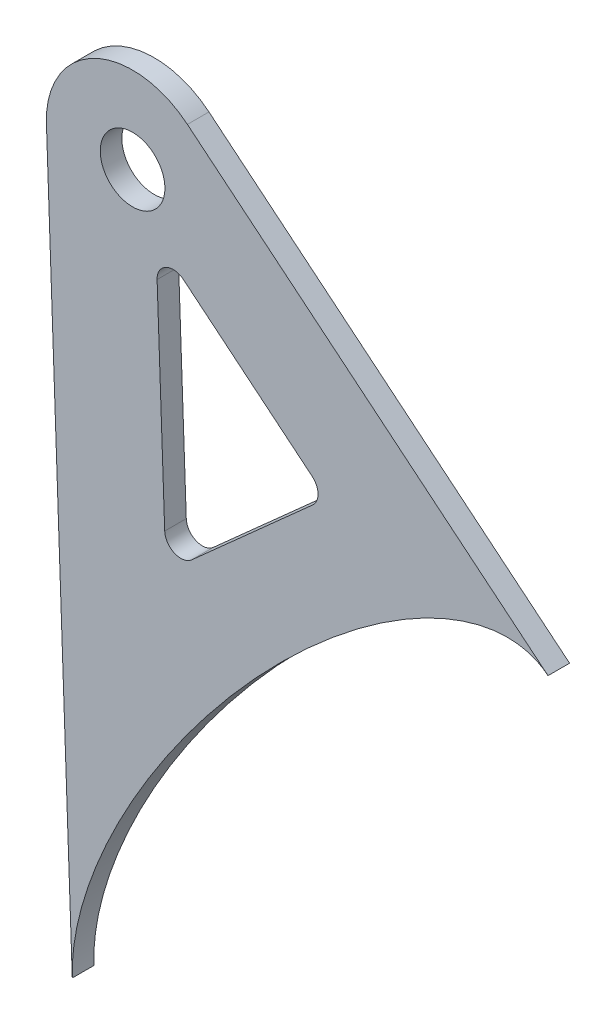
ISO-10303-21;
HEADER;
FILE_DESCRIPTION(('STEP AP214'),'2;1');
FILE_NAME('part.step','',(''),(''),'','','');
FILE_SCHEMA(('AUTOMOTIVE_DESIGN { 1 0 10303 214 1 1 1 1 }'));
ENDSEC;
DATA;
#1=APPLICATION_CONTEXT('core data for automotive mechanical design processes');
#2=APPLICATION_PROTOCOL_DEFINITION('international standard','automotive_design',2000,#1);
#3=PRODUCT_CONTEXT('',#1,'mechanical');
#4=PRODUCT('Part','Part','',(#3));
#5=PRODUCT_RELATED_PRODUCT_CATEGORY('part','',(#4));
#6=PRODUCT_DEFINITION_FORMATION('','',#4);
#7=PRODUCT_DEFINITION_CONTEXT('part definition',#1,'design');
#8=PRODUCT_DEFINITION('design','',#6,#7);
#9=PRODUCT_DEFINITION_SHAPE('','',#8);
#10=(LENGTH_UNIT() NAMED_UNIT(*) SI_UNIT(.MILLI.,.METRE.));
#11=(NAMED_UNIT(*) PLANE_ANGLE_UNIT() SI_UNIT($,.RADIAN.));
#12=(NAMED_UNIT(*) SI_UNIT($,.STERADIAN.) SOLID_ANGLE_UNIT());
#13=UNCERTAINTY_MEASURE_WITH_UNIT(LENGTH_MEASURE(1.E-05),#10,'distance_accuracy_value','');
#14=(GEOMETRIC_REPRESENTATION_CONTEXT(3) GLOBAL_UNCERTAINTY_ASSIGNED_CONTEXT((#13)) GLOBAL_UNIT_ASSIGNED_CONTEXT((#10,
#11,#12)) REPRESENTATION_CONTEXT('',''));
#15=CARTESIAN_POINT('',(0.,0.,0.));
#16=DIRECTION('',(0.,0.,1.));
#17=DIRECTION('',(1.,0.,0.));
#18=AXIS2_PLACEMENT_3D('',#15,#16,#17);
#19=CARTESIAN_POINT('',(1375.39150654888,-231.129570023266,434.28));
#20=DIRECTION('',(0.,0.,1.));
#21=DIRECTION('',(0.,-1.,0.));
#22=AXIS2_PLACEMENT_3D('',#19,#20,#21);
#23=PLANE('',#22);
#24=DIRECTION('',(0.035527138054527,-0.999368711968538,0.));
#25=VECTOR('',#24,1.);
#26=CARTESIAN_POINT('',(1352.00505030431,-200.284217104434,434.28));
#27=LINE('',#26,#25);
#28=CARTESIAN_POINT('',(1352.00505030431,-200.284217104434,434.28));
#29=VERTEX_POINT('',#28);
#30=CARTESIAN_POINT('',(1354.40386942977,-267.762345400856,434.28));
#31=VERTEX_POINT('',#30);
#32=EDGE_CURVE('E220',#29,#31,#27,.T.);
#33=ORIENTED_EDGE('',*,*,#32,.T.);
#34=CARTESIAN_POINT('',(1354.40386942977,-267.762345400856,434.28));
#35=CARTESIAN_POINT('',(1353.43245275836,-240.436659155121,434.28));
#36=CARTESIAN_POINT('',(1386.53706756762,-211.615049683143,434.28));
#37=CARTESIAN_POINT('',(1398.52725809821,-221.376205911584,434.28));
#38=CARTESIAN_POINT('',(1398.53435990197,-221.381987455749,434.28));
#39=CARTESIAN_POINT('',(1398.54144739585,-221.387791883071,434.28));
#40=CARTESIAN_POINT('',(1398.54852053125,-221.393619229834,434.28));
#41=(BOUNDED_CURVE() B_SPLINE_CURVE(3,(#34,#35,#36,#37,#38,#39,#40),.UNSPECIFIED.,.F.,
.F.) B_SPLINE_CURVE_WITH_KNOTS((4,3,4),(0.0852875382307011,0.5,0.500549054517509),
.UNSPECIFIED.) CURVE() GEOMETRIC_REPRESENTATION_ITEM() RATIONAL_B_SPLINE_CURVE((0.717041560496822,
0.352730571139875,0.447050050974268,1.,0.999267927309988,0.998536658515611,0.99780619361687)) REPRESENTATION_ITEM(''));
#42=CARTESIAN_POINT('',(1398.54852053125,-221.393619229834,434.28));
#43=VERTEX_POINT('',#42);
#44=EDGE_CURVE('E223',#31,#43,#41,.T.);
#45=ORIENTED_EDGE('',*,*,#44,.T.);
#46=DIRECTION('',(0.771801080668979,-0.635864051412089,0.));
#47=VECTOR('',#46,1.);
#48=CARTESIAN_POINT('',(1365.08691241126,-193.825591354697,434.28));
#49=LINE('',#48,#47);
#50=CARTESIAN_POINT('',(1365.08691241126,-193.825591354697,434.28));
#51=VERTEX_POINT('',#50);
#52=EDGE_CURVE('E229',#51,#43,#49,.T.);
#53=ORIENTED_EDGE('',*,*,#52,.F.);
#54=CARTESIAN_POINT('',(1360.,-200.,434.28));
#55=DIRECTION('',(0.,0.,1.));
#56=DIRECTION('',(1.,0.,0.));
#57=AXIS2_PLACEMENT_3D('',#54,#55,#56);
#58=CIRCLE('',#57,7.99999999993676);
#59=EDGE_CURVE('E377',#51,#29,#58,.T.);
#60=ORIENTED_EDGE('',*,*,#59,.T.);
#61=EDGE_LOOP('',(#33,#45,#53,#60));
#62=FACE_BOUND('',#61,.T.);
#63=CARTESIAN_POINT('',(1364.47997732206,-227.50430289175,434.28));
#64=DIRECTION('',(0.,0.,1.));
#65=DIRECTION('',(1.,0.,0.));
#66=AXIS2_PLACEMENT_3D('',#63,#64,#65);
#67=CIRCLE('',#66,1.49999999999995);
#68=CARTESIAN_POINT('',(1365.47901822837,-228.623193980065,434.28));
#69=VERTEX_POINT('',#68);
#70=CARTESIAN_POINT('',(1362.9809242541,-227.557593598832,434.28));
#71=VERTEX_POINT('',#70);
#72=EDGE_CURVE('E179',#69,#71,#67,.F.);
#73=ORIENTED_EDGE('',*,*,#72,.T.);
#74=DIRECTION('',(0.0355271380545357,-0.999368711968538,0.));
#75=VECTOR('',#74,1.);
#76=CARTESIAN_POINT('',(1353.18123393235,48.1050246370281,434.28));
#77=LINE('',#76,#75);
#78=CARTESIAN_POINT('',(1362.27490228427,-207.697387985437,434.28));
#79=VERTEX_POINT('',#78);
#80=EDGE_CURVE('E197',#79,#71,#77,.T.);
#81=ORIENTED_EDGE('',*,*,#80,.F.);
#82=CARTESIAN_POINT('',(1363.77395535222,-207.644097278355,434.28));
#83=DIRECTION('',(0.,0.,1.));
#84=DIRECTION('',(1.,0.,0.));
#85=AXIS2_PLACEMENT_3D('',#82,#83,#84);
#86=CIRCLE('',#85,1.50000000000002);
#87=CARTESIAN_POINT('',(1364.72775142934,-206.486395657352,434.28));
#88=VERTEX_POINT('',#87);
#89=EDGE_CURVE('E195',#88,#79,#86,.T.);
#90=ORIENTED_EDGE('',*,*,#89,.F.);
#91=DIRECTION('',(0.771801080668963,-0.635864051412109,0.));
#92=VECTOR('',#91,1.);
#93=CARTESIAN_POINT('',(450.455564443834,546.755380586496,434.28));
#94=LINE('',#93,#92);
#95=CARTESIAN_POINT('',(1376.66340859259,-216.319830087778,434.28));
#96=VERTEX_POINT('',#95);
#97=EDGE_CURVE('E190',#88,#96,#94,.T.);
#98=ORIENTED_EDGE('',*,*,#97,.T.);
#99=CARTESIAN_POINT('',(1375.70961251547,-217.477531708782,434.28));
#100=DIRECTION('',(0.,0.,1.));
#101=DIRECTION('',(1.,0.,0.));
#102=AXIS2_PLACEMENT_3D('',#99,#100,#101);
#103=CIRCLE('',#102,1.50000000000003);
#104=CARTESIAN_POINT('',(1376.70865342178,-218.596422797098,434.28));
#105=VERTEX_POINT('',#104);
#106=EDGE_CURVE('E188',#105,#96,#103,.T.);
#107=ORIENTED_EDGE('',*,*,#106,.F.);
#108=DIRECTION('',(-0.745927392210289,-0.666027270875869,0.));
#109=VECTOR('',#108,1.);
#110=CARTESIAN_POINT('',(719.297841581458,-805.588579710492,434.28));
#111=LINE('',#110,#109);
#112=EDGE_CURVE('E171',#105,#69,#111,.T.);
#113=ORIENTED_EDGE('',*,*,#112,.T.);
#114=EDGE_LOOP('',(#73,#81,#90,#98,#107,#113));
#115=FACE_BOUND('',#114,.T.);
#116=CARTESIAN_POINT('',(1360.,-200.,434.28));
#117=DIRECTION('',(0.,0.,1.));
#118=DIRECTION('',(1.,0.,0.));
#119=AXIS2_PLACEMENT_3D('',#116,#117,#118);
#120=CIRCLE('',#119,2.99999999999993);
#121=CARTESIAN_POINT('',(1363.,-200.,434.28));
#122=VERTEX_POINT('',#121);
#123=EDGE_CURVE('E200',#122,#122,#120,.T.);
#124=ORIENTED_EDGE('',*,*,#123,.F.);
#125=EDGE_LOOP('',(#124));
#126=FACE_BOUND('',#125,.T.);
#127=ADVANCED_FACE('F89',(#62,#115,#126),#23,.T.);
#128=CARTESIAN_POINT('',(1375.39150654888,-231.129570023266,432.28));
#129=DIRECTION('',(0.,0.,1.));
#130=DIRECTION('',(0.,-1.,0.));
#131=AXIS2_PLACEMENT_3D('',#128,#129,#130);
#132=PLANE('',#131);
#133=DIRECTION('',(0.0355271380545357,-0.999368711968538,0.));
#134=VECTOR('',#133,1.);
#135=CARTESIAN_POINT('',(1353.18123393235,48.1050246370281,432.28));
#136=LINE('',#135,#134);
#137=CARTESIAN_POINT('',(1362.27490228427,-207.697387985437,432.28));
#138=VERTEX_POINT('',#137);
#139=CARTESIAN_POINT('',(1362.9809242541,-227.557593598832,432.28));
#140=VERTEX_POINT('',#139);
#141=EDGE_CURVE('E184',#138,#140,#136,.T.);
#142=ORIENTED_EDGE('',*,*,#141,.T.);
#143=CARTESIAN_POINT('',(1364.47997732206,-227.50430289175,432.28));
#144=DIRECTION('',(0.,0.,1.));
#145=DIRECTION('',(1.,0.,0.));
#146=AXIS2_PLACEMENT_3D('',#143,#144,#145);
#147=CIRCLE('',#146,1.49999999999995);
#148=CARTESIAN_POINT('',(1365.47901822837,-228.623193980065,432.28));
#149=VERTEX_POINT('',#148);
#150=EDGE_CURVE('E112',#149,#140,#147,.F.);
#151=ORIENTED_EDGE('',*,*,#150,.F.);
#152=DIRECTION('',(-0.745927392210289,-0.666027270875869,0.));
#153=VECTOR('',#152,1.);
#154=CARTESIAN_POINT('',(719.297841581458,-805.588579710492,432.28));
#155=LINE('',#154,#153);
#156=CARTESIAN_POINT('',(1376.70865342178,-218.596422797098,432.28));
#157=VERTEX_POINT('',#156);
#158=EDGE_CURVE('E174',#157,#149,#155,.T.);
#159=ORIENTED_EDGE('',*,*,#158,.F.);
#160=CARTESIAN_POINT('',(1375.70961251547,-217.477531708782,432.28));
#161=DIRECTION('',(0.,0.,1.));
#162=DIRECTION('',(1.,0.,0.));
#163=AXIS2_PLACEMENT_3D('',#160,#161,#162);
#164=CIRCLE('',#163,1.50000000000003);
#165=CARTESIAN_POINT('',(1376.66340859259,-216.319830087778,432.28));
#166=VERTEX_POINT('',#165);
#167=EDGE_CURVE('E202',#157,#166,#164,.T.);
#168=ORIENTED_EDGE('',*,*,#167,.T.);
#169=DIRECTION('',(0.771801080668963,-0.635864051412109,0.));
#170=VECTOR('',#169,1.);
#171=CARTESIAN_POINT('',(450.455564443834,546.755380586496,432.28));
#172=LINE('',#171,#170);
#173=CARTESIAN_POINT('',(1364.72775142934,-206.486395657352,432.28));
#174=VERTEX_POINT('',#173);
#175=EDGE_CURVE('E205',#174,#166,#172,.T.);
#176=ORIENTED_EDGE('',*,*,#175,.F.);
#177=CARTESIAN_POINT('',(1363.77395535222,-207.644097278355,432.28));
#178=DIRECTION('',(0.,0.,1.));
#179=DIRECTION('',(1.,0.,0.));
#180=AXIS2_PLACEMENT_3D('',#177,#178,#179);
#181=CIRCLE('',#180,1.50000000000002);
#182=EDGE_CURVE('E208',#174,#138,#181,.T.);
#183=ORIENTED_EDGE('',*,*,#182,.T.);
#184=EDGE_LOOP('',(#142,#151,#159,#168,#176,#183));
#185=FACE_BOUND('',#184,.T.);
#186=DIRECTION('',(0.035527138054527,-0.999368711968538,0.));
#187=VECTOR('',#186,1.);
#188=CARTESIAN_POINT('',(1352.00505030431,-200.284217104434,432.28));
#189=LINE('',#188,#187);
#190=CARTESIAN_POINT('',(1352.00505030431,-200.284217104434,432.28));
#191=VERTEX_POINT('',#190);
#192=CARTESIAN_POINT('',(1354.40386942977,-267.762345400856,432.28));
#193=VERTEX_POINT('',#192);
#194=EDGE_CURVE('E175',#191,#193,#189,.T.);
#195=ORIENTED_EDGE('',*,*,#194,.F.);
#196=CARTESIAN_POINT('',(1360.,-200.,432.28));
#197=DIRECTION('',(0.,0.,1.));
#198=DIRECTION('',(1.,0.,0.));
#199=AXIS2_PLACEMENT_3D('',#196,#197,#198);
#200=CIRCLE('',#199,7.99999999993676);
#201=CARTESIAN_POINT('',(1365.08691241126,-193.825591354697,432.28));
#202=VERTEX_POINT('',#201);
#203=EDGE_CURVE('E224',#202,#191,#200,.T.);
#204=ORIENTED_EDGE('',*,*,#203,.F.);
#205=DIRECTION('',(0.771801080668979,-0.635864051412089,0.));
#206=VECTOR('',#205,1.);
#207=CARTESIAN_POINT('',(1365.08691241126,-193.825591354697,432.28));
#208=LINE('',#207,#206);
#209=CARTESIAN_POINT('',(1398.54852053125,-221.393619229834,432.28));
#210=VERTEX_POINT('',#209);
#211=EDGE_CURVE('E375',#202,#210,#208,.T.);
#212=ORIENTED_EDGE('',*,*,#211,.T.);
#213=CARTESIAN_POINT('',(1354.40386942977,-267.762345400856,432.28));
#214=CARTESIAN_POINT('',(1353.43245275836,-240.436659155121,432.28));
#215=CARTESIAN_POINT('',(1386.53706756762,-211.615049683143,432.28));
#216=CARTESIAN_POINT('',(1398.52725809821,-221.376205911584,432.28));
#217=CARTESIAN_POINT('',(1398.53435990197,-221.381987455749,432.28));
#218=CARTESIAN_POINT('',(1398.54144739585,-221.387791883071,432.28));
#219=CARTESIAN_POINT('',(1398.54852053125,-221.393619229834,432.28));
#220=(BOUNDED_CURVE() B_SPLINE_CURVE(3,(#213,#214,#215,#216,#217,#218,#219),.UNSPECIFIED.,.F.,
.F.) B_SPLINE_CURVE_WITH_KNOTS((4,3,4),(0.0852875382307011,0.5,0.500549054517509),
.UNSPECIFIED.) CURVE() GEOMETRIC_REPRESENTATION_ITEM() RATIONAL_B_SPLINE_CURVE((0.717041560496822,
0.352730571139875,0.447050050974268,1.,0.999267927309988,0.998536658515611,0.99780619361687)) REPRESENTATION_ITEM(''));
#221=EDGE_CURVE('E372',#193,#210,#220,.T.);
#222=ORIENTED_EDGE('',*,*,#221,.F.);
#223=EDGE_LOOP('',(#195,#204,#212,#222));
#224=FACE_BOUND('',#223,.T.);
#225=CARTESIAN_POINT('',(1360.,-200.,432.28));
#226=DIRECTION('',(0.,0.,1.));
#227=DIRECTION('',(1.,0.,0.));
#228=AXIS2_PLACEMENT_3D('',#225,#226,#227);
#229=CIRCLE('',#228,2.99999999999993);
#230=CARTESIAN_POINT('',(1363.,-200.,432.28));
#231=VERTEX_POINT('',#230);
#232=EDGE_CURVE('E282',#231,#231,#229,.T.);
#233=ORIENTED_EDGE('',*,*,#232,.T.);
#234=EDGE_LOOP('',(#233));
#235=FACE_BOUND('',#234,.T.);
#236=ADVANCED_FACE('F246',(#185,#224,#235),#132,.F.);
#237=CARTESIAN_POINT('',(1352.00505030431,-200.284217104434,434.28));
#238=DIRECTION('',(0.999368711968538,0.035527138054527,0.));
#239=DIRECTION('',(-0.035527138054527,0.999368711968538,0.));
#240=AXIS2_PLACEMENT_3D('',#237,#238,#239);
#241=PLANE('',#240);
#242=ORIENTED_EDGE('',*,*,#194,.T.);
#243=DIRECTION('',(0.,0.,-1.));
#244=VECTOR('',#243,1.);
#245=CARTESIAN_POINT('',(1354.40386942977,-267.762345400856,434.28));
#246=LINE('',#245,#244);
#247=EDGE_CURVE('E12',#31,#193,#246,.T.);
#248=ORIENTED_EDGE('',*,*,#247,.F.);
#249=ORIENTED_EDGE('',*,*,#32,.F.);
#250=DIRECTION('',(0.,0.,-1.));
#251=VECTOR('',#250,1.);
#252=CARTESIAN_POINT('',(1352.00505030431,-200.284217104434,434.28));
#253=LINE('',#252,#251);
#254=EDGE_CURVE('E369',#29,#191,#253,.T.);
#255=ORIENTED_EDGE('',*,*,#254,.T.);
#256=EDGE_LOOP('',(#242,#248,#249,#255));
#257=FACE_BOUND('',#256,.T.);
#258=ADVANCED_FACE('F91',(#257),#241,.F.);
#259=DIRECTION('',(0.,0.,-1.));
#260=VECTOR('',#259,1.);
#261=SURFACE_OF_LINEAR_EXTRUSION('',#41,#260);
#262=ORIENTED_EDGE('',*,*,#221,.T.);
#263=DIRECTION('',(0.,0.,-1.));
#264=VECTOR('',#263,1.);
#265=CARTESIAN_POINT('',(1398.54852053125,-221.393619229834,434.28));
#266=LINE('',#265,#264);
#267=EDGE_CURVE('E97',#43,#210,#266,.T.);
#268=ORIENTED_EDGE('',*,*,#267,.F.);
#269=ORIENTED_EDGE('',*,*,#44,.F.);
#270=ORIENTED_EDGE('',*,*,#247,.T.);
#271=EDGE_LOOP('',(#262,#268,#269,#270));
#272=FACE_BOUND('',#271,.T.);
#273=ADVANCED_FACE('F234',(#272),#261,.F.);
#274=CARTESIAN_POINT('',(1365.08691241126,-193.825591354697,434.28));
#275=DIRECTION('',(0.635864051412089,0.771801080668979,0.));
#276=DIRECTION('',(-0.771801080668979,0.635864051412089,0.));
#277=AXIS2_PLACEMENT_3D('',#274,#275,#276);
#278=PLANE('',#277);
#279=ORIENTED_EDGE('',*,*,#211,.F.);
#280=DIRECTION('',(0.,0.,-1.));
#281=VECTOR('',#280,1.);
#282=CARTESIAN_POINT('',(1365.08691241126,-193.825591354697,434.28));
#283=LINE('',#282,#281);
#284=EDGE_CURVE('E388',#51,#202,#283,.T.);
#285=ORIENTED_EDGE('',*,*,#284,.F.);
#286=ORIENTED_EDGE('',*,*,#52,.T.);
#287=ORIENTED_EDGE('',*,*,#267,.T.);
#288=EDGE_LOOP('',(#279,#285,#286,#287));
#289=FACE_BOUND('',#288,.T.);
#290=ADVANCED_FACE('F237',(#289),#278,.T.);
#291=CARTESIAN_POINT('',(1360.,-200.,434.28));
#292=DIRECTION('',(0.,0.,-1.));
#293=DIRECTION('',(-1.,0.,0.));
#294=AXIS2_PLACEMENT_3D('',#291,#292,#293);
#295=CYLINDRICAL_SURFACE('',#294,7.99999999993676);
#296=ORIENTED_EDGE('',*,*,#203,.T.);
#297=ORIENTED_EDGE('',*,*,#254,.F.);
#298=ORIENTED_EDGE('',*,*,#59,.F.);
#299=ORIENTED_EDGE('',*,*,#284,.T.);
#300=EDGE_LOOP('',(#296,#297,#298,#299));
#301=FACE_BOUND('',#300,.T.);
#302=ADVANCED_FACE('F241',(#301),#295,.T.);
#303=CARTESIAN_POINT('',(1364.47997732206,-227.50430289175,434.28));
#304=DIRECTION('',(0.,0.,-1.));
#305=DIRECTION('',(-1.,0.,0.));
#306=AXIS2_PLACEMENT_3D('',#303,#304,#305);
#307=CYLINDRICAL_SURFACE('',#306,1.49999999999995);
#308=ORIENTED_EDGE('',*,*,#150,.T.);
#309=DIRECTION('',(0.,0.,-1.));
#310=VECTOR('',#309,1.);
#311=CARTESIAN_POINT('',(1362.9809242541,-227.557593598832,434.28));
#312=LINE('',#311,#310);
#313=EDGE_CURVE('E181',#71,#140,#312,.T.);
#314=ORIENTED_EDGE('',*,*,#313,.F.);
#315=ORIENTED_EDGE('',*,*,#72,.F.);
#316=DIRECTION('',(0.,0.,-1.));
#317=VECTOR('',#316,1.);
#318=CARTESIAN_POINT('',(1365.47901822837,-228.623193980065,434.28));
#319=LINE('',#318,#317);
#320=EDGE_CURVE('E167',#69,#149,#319,.T.);
#321=ORIENTED_EDGE('',*,*,#320,.T.);
#322=EDGE_LOOP('',(#308,#314,#315,#321));
#323=FACE_BOUND('',#322,.T.);
#324=ADVANCED_FACE('F180',(#323),#307,.F.);
#325=CARTESIAN_POINT('',(719.297841581458,-805.588579710492,434.28));
#326=DIRECTION('',(0.666027270875869,-0.745927392210289,0.));
#327=DIRECTION('',(0.745927392210289,0.666027270875869,0.));
#328=AXIS2_PLACEMENT_3D('',#325,#326,#327);
#329=PLANE('',#328);
#330=ORIENTED_EDGE('',*,*,#158,.T.);
#331=ORIENTED_EDGE('',*,*,#320,.F.);
#332=ORIENTED_EDGE('',*,*,#112,.F.);
#333=DIRECTION('',(0.,0.,-1.));
#334=VECTOR('',#333,1.);
#335=CARTESIAN_POINT('',(1376.70865342178,-218.596422797098,434.28));
#336=LINE('',#335,#334);
#337=EDGE_CURVE('E176',#105,#157,#336,.T.);
#338=ORIENTED_EDGE('',*,*,#337,.T.);
#339=EDGE_LOOP('',(#330,#331,#332,#338));
#340=FACE_BOUND('',#339,.T.);
#341=ADVANCED_FACE('F169',(#340),#329,.F.);
#342=CARTESIAN_POINT('',(1375.70961251547,-217.477531708782,434.28));
#343=DIRECTION('',(0.,0.,-1.));
#344=DIRECTION('',(-1.,0.,0.));
#345=AXIS2_PLACEMENT_3D('',#342,#343,#344);
#346=CYLINDRICAL_SURFACE('',#345,1.50000000000003);
#347=ORIENTED_EDGE('',*,*,#167,.F.);
#348=ORIENTED_EDGE('',*,*,#337,.F.);
#349=ORIENTED_EDGE('',*,*,#106,.T.);
#350=DIRECTION('',(0.,0.,-1.));
#351=VECTOR('',#350,1.);
#352=CARTESIAN_POINT('',(1376.66340859259,-216.319830087778,434.28));
#353=LINE('',#352,#351);
#354=EDGE_CURVE('E217',#96,#166,#353,.T.);
#355=ORIENTED_EDGE('',*,*,#354,.T.);
#356=EDGE_LOOP('',(#347,#348,#349,#355));
#357=FACE_BOUND('',#356,.T.);
#358=ADVANCED_FACE('F257',(#357),#346,.F.);
#359=CARTESIAN_POINT('',(450.455564443834,546.755380586496,434.28));
#360=DIRECTION('',(0.635864051412109,0.771801080668963,0.));
#361=DIRECTION('',(-0.771801080668963,0.635864051412109,0.));
#362=AXIS2_PLACEMENT_3D('',#359,#360,#361);
#363=PLANE('',#362);
#364=ORIENTED_EDGE('',*,*,#175,.T.);
#365=ORIENTED_EDGE('',*,*,#354,.F.);
#366=ORIENTED_EDGE('',*,*,#97,.F.);
#367=DIRECTION('',(0.,0.,-1.));
#368=VECTOR('',#367,1.);
#369=CARTESIAN_POINT('',(1364.72775142934,-206.486395657352,434.28));
#370=LINE('',#369,#368);
#371=EDGE_CURVE('E215',#88,#174,#370,.T.);
#372=ORIENTED_EDGE('',*,*,#371,.T.);
#373=EDGE_LOOP('',(#364,#365,#366,#372));
#374=FACE_BOUND('',#373,.T.);
#375=ADVANCED_FACE('F260',(#374),#363,.F.);
#376=CARTESIAN_POINT('',(1363.77395535222,-207.644097278355,434.28));
#377=DIRECTION('',(0.,0.,-1.));
#378=DIRECTION('',(-1.,0.,0.));
#379=AXIS2_PLACEMENT_3D('',#376,#377,#378);
#380=CYLINDRICAL_SURFACE('',#379,1.50000000000002);
#381=ORIENTED_EDGE('',*,*,#182,.F.);
#382=ORIENTED_EDGE('',*,*,#371,.F.);
#383=ORIENTED_EDGE('',*,*,#89,.T.);
#384=DIRECTION('',(0.,0.,-1.));
#385=VECTOR('',#384,1.);
#386=CARTESIAN_POINT('',(1362.27490228427,-207.697387985437,434.28));
#387=LINE('',#386,#385);
#388=EDGE_CURVE('E104',#79,#138,#387,.T.);
#389=ORIENTED_EDGE('',*,*,#388,.T.);
#390=EDGE_LOOP('',(#381,#382,#383,#389));
#391=FACE_BOUND('',#390,.T.);
#392=ADVANCED_FACE('F264',(#391),#380,.F.);
#393=CARTESIAN_POINT('',(1353.18123393235,48.1050246370281,434.28));
#394=DIRECTION('',(0.999368711968538,0.0355271380545357,0.));
#395=DIRECTION('',(-0.0355271380545357,0.999368711968538,0.));
#396=AXIS2_PLACEMENT_3D('',#393,#394,#395);
#397=PLANE('',#396);
#398=ORIENTED_EDGE('',*,*,#141,.F.);
#399=ORIENTED_EDGE('',*,*,#388,.F.);
#400=ORIENTED_EDGE('',*,*,#80,.T.);
#401=ORIENTED_EDGE('',*,*,#313,.T.);
#402=EDGE_LOOP('',(#398,#399,#400,#401));
#403=FACE_BOUND('',#402,.T.);
#404=ADVANCED_FACE('F268',(#403),#397,.T.);
#405=CARTESIAN_POINT('',(1360.,-200.,434.28));
#406=DIRECTION('',(0.,0.,-1.));
#407=DIRECTION('',(-1.,0.,0.));
#408=AXIS2_PLACEMENT_3D('',#405,#406,#407);
#409=CYLINDRICAL_SURFACE('',#408,2.99999999999993);
#410=ORIENTED_EDGE('',*,*,#123,.T.);
#411=EDGE_LOOP('',(#410));
#412=FACE_BOUND('',#411,.T.);
#413=ORIENTED_EDGE('',*,*,#232,.F.);
#414=EDGE_LOOP('',(#413));
#415=FACE_BOUND('',#414,.T.);
#416=ADVANCED_FACE('F272',(#412,#415),#409,.F.);
#417=CLOSED_SHELL('',(#127,#236,#258,#273,#290,#302,#324,#341,#358,#375,#392,#404,#416));
#418=MANIFOLD_SOLID_BREP('B2',#417);
#419=ADVANCED_BREP_SHAPE_REPRESENTATION('',(#18,#418),#14);
#420=SHAPE_DEFINITION_REPRESENTATION(#9,#419);
ENDSEC;
END-ISO-10303-21;
